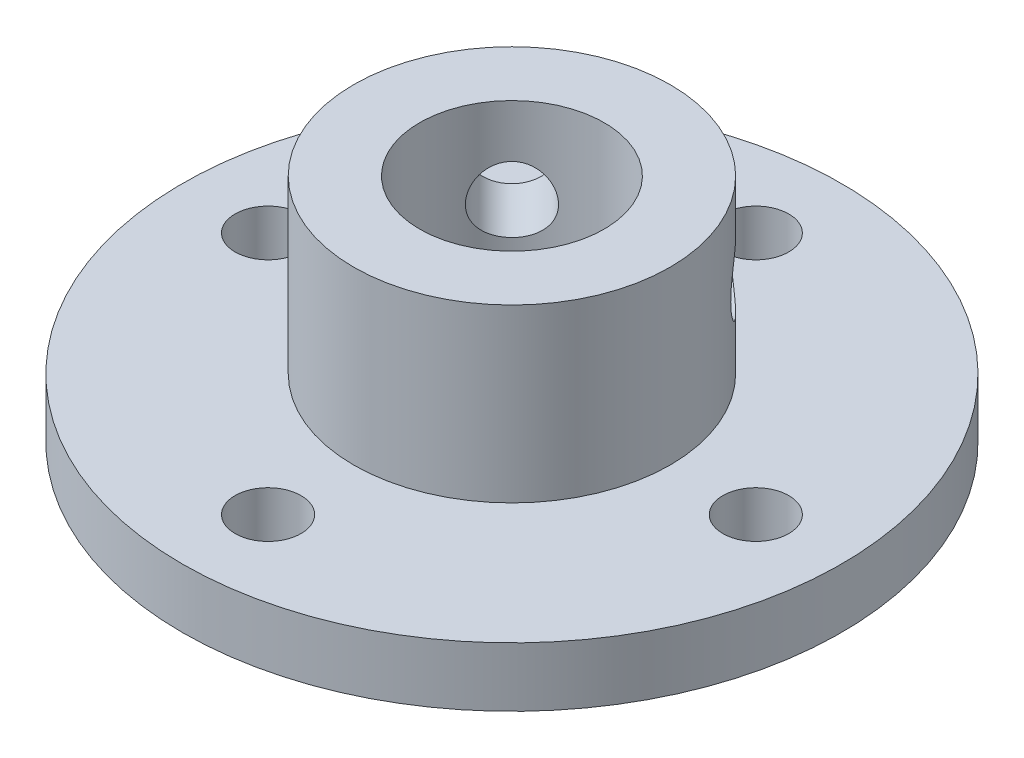
ISO-10303-21;
HEADER;
FILE_DESCRIPTION(('STEP AP214'),'2;1');
FILE_NAME('part.step','',(''),(''),'','','');
FILE_SCHEMA(('AUTOMOTIVE_DESIGN { 1 0 10303 214 1 1 1 1 }'));
ENDSEC;
DATA;
#1=APPLICATION_CONTEXT('core data for automotive mechanical design processes');
#2=APPLICATION_PROTOCOL_DEFINITION('international standard','automotive_design',2000,#1);
#3=PRODUCT_CONTEXT('',#1,'mechanical');
#4=PRODUCT('Part','Part','',(#3));
#5=PRODUCT_RELATED_PRODUCT_CATEGORY('part','',(#4));
#6=PRODUCT_DEFINITION_FORMATION('','',#4);
#7=PRODUCT_DEFINITION_CONTEXT('part definition',#1,'design');
#8=PRODUCT_DEFINITION('design','',#6,#7);
#9=PRODUCT_DEFINITION_SHAPE('','',#8);
#10=(LENGTH_UNIT() NAMED_UNIT(*) SI_UNIT(.MILLI.,.METRE.));
#11=(NAMED_UNIT(*) PLANE_ANGLE_UNIT() SI_UNIT($,.RADIAN.));
#12=(NAMED_UNIT(*) SI_UNIT($,.STERADIAN.) SOLID_ANGLE_UNIT());
#13=UNCERTAINTY_MEASURE_WITH_UNIT(LENGTH_MEASURE(1.E-05),#10,'distance_accuracy_value','');
#14=(GEOMETRIC_REPRESENTATION_CONTEXT(3) GLOBAL_UNCERTAINTY_ASSIGNED_CONTEXT((#13)) GLOBAL_UNIT_ASSIGNED_CONTEXT((#10,
#11,#12)) REPRESENTATION_CONTEXT('',''));
#15=CARTESIAN_POINT('',(0.,0.,0.));
#16=DIRECTION('',(0.,0.,1.));
#17=DIRECTION('',(1.,0.,0.));
#18=AXIS2_PLACEMENT_3D('',#15,#16,#17);
#19=CARTESIAN_POINT('',(0.,4.5,0.));
#20=DIRECTION('',(0.,-1.,0.));
#21=DIRECTION('',(0.,0.,-1.));
#22=AXIS2_PLACEMENT_3D('',#19,#20,#21);
#23=CYLINDRICAL_SURFACE('',#22,25.);
#24=CARTESIAN_POINT('',(0.,4.5,0.));
#25=DIRECTION('',(0.,1.,0.));
#26=DIRECTION('',(0.,0.,1.));
#27=AXIS2_PLACEMENT_3D('',#24,#25,#26);
#28=CIRCLE('',#27,25.);
#29=CARTESIAN_POINT('',(0.,4.5,25.));
#30=VERTEX_POINT('',#29);
#31=EDGE_CURVE('E49',#30,#30,#28,.T.);
#32=ORIENTED_EDGE('',*,*,#31,.F.);
#33=EDGE_LOOP('',(#32));
#34=FACE_BOUND('',#33,.T.);
#35=CARTESIAN_POINT('',(0.,0.,0.));
#36=DIRECTION('',(0.,1.,0.));
#37=DIRECTION('',(0.,0.,1.));
#38=AXIS2_PLACEMENT_3D('',#35,#36,#37);
#39=CIRCLE('',#38,25.);
#40=CARTESIAN_POINT('',(0.,0.,25.));
#41=VERTEX_POINT('',#40);
#42=EDGE_CURVE('E54',#41,#41,#39,.T.);
#43=ORIENTED_EDGE('',*,*,#42,.T.);
#44=EDGE_LOOP('',(#43));
#45=FACE_BOUND('',#44,.T.);
#46=ADVANCED_FACE('F37',(#34,#45),#23,.T.);
#47=CARTESIAN_POINT('',(0.,4.5,0.));
#48=DIRECTION('',(0.,1.,0.));
#49=DIRECTION('',(0.,0.,1.));
#50=AXIS2_PLACEMENT_3D('',#47,#48,#49);
#51=PLANE('',#50);
#52=CARTESIAN_POINT('',(-18.5,4.5,0.));
#53=DIRECTION('',(0.,1.,0.));
#54=DIRECTION('',(0.,0.,1.));
#55=AXIS2_PLACEMENT_3D('',#52,#53,#54);
#56=CIRCLE('',#55,2.5);
#57=CARTESIAN_POINT('',(-18.5,4.5,2.5));
#58=VERTEX_POINT('',#57);
#59=EDGE_CURVE('E95',#58,#58,#56,.T.);
#60=ORIENTED_EDGE('',*,*,#59,.F.);
#61=EDGE_LOOP('',(#60));
#62=FACE_BOUND('',#61,.T.);
#63=CARTESIAN_POINT('',(0.,4.5,-18.5));
#64=DIRECTION('',(0.,1.,0.));
#65=DIRECTION('',(0.,0.,1.));
#66=AXIS2_PLACEMENT_3D('',#63,#64,#65);
#67=CIRCLE('',#66,2.5);
#68=CARTESIAN_POINT('',(0.,4.5,-16.));
#69=VERTEX_POINT('',#68);
#70=EDGE_CURVE('E239',#69,#69,#67,.T.);
#71=ORIENTED_EDGE('',*,*,#70,.F.);
#72=EDGE_LOOP('',(#71));
#73=FACE_BOUND('',#72,.T.);
#74=CARTESIAN_POINT('',(18.5,4.5,0.));
#75=DIRECTION('',(0.,1.,0.));
#76=DIRECTION('',(0.,0.,1.));
#77=AXIS2_PLACEMENT_3D('',#74,#75,#76);
#78=CIRCLE('',#77,2.5);
#79=CARTESIAN_POINT('',(18.5,4.5,2.5));
#80=VERTEX_POINT('',#79);
#81=EDGE_CURVE('E218',#80,#80,#78,.T.);
#82=ORIENTED_EDGE('',*,*,#81,.F.);
#83=EDGE_LOOP('',(#82));
#84=FACE_BOUND('',#83,.T.);
#85=CARTESIAN_POINT('',(0.,4.5,18.5));
#86=DIRECTION('',(0.,1.,0.));
#87=DIRECTION('',(0.,0.,1.));
#88=AXIS2_PLACEMENT_3D('',#85,#86,#87);
#89=CIRCLE('',#88,2.5);
#90=CARTESIAN_POINT('',(0.,4.5,21.));
#91=VERTEX_POINT('',#90);
#92=EDGE_CURVE('E213',#91,#91,#89,.T.);
#93=ORIENTED_EDGE('',*,*,#92,.F.);
#94=EDGE_LOOP('',(#93));
#95=FACE_BOUND('',#94,.T.);
#96=CARTESIAN_POINT('',(0.,4.5,0.));
#97=DIRECTION('',(0.,1.,0.));
#98=DIRECTION('',(0.,0.,1.));
#99=AXIS2_PLACEMENT_3D('',#96,#97,#98);
#100=CIRCLE('',#99,12.);
#101=CARTESIAN_POINT('',(0.,4.5,12.));
#102=VERTEX_POINT('',#101);
#103=EDGE_CURVE('E10',#102,#102,#100,.T.);
#104=ORIENTED_EDGE('',*,*,#103,.F.);
#105=EDGE_LOOP('',(#104));
#106=FACE_BOUND('',#105,.T.);
#107=ORIENTED_EDGE('',*,*,#31,.T.);
#108=EDGE_LOOP('',(#107));
#109=FACE_BOUND('',#108,.T.);
#110=ADVANCED_FACE('F104',(#62,#73,#84,#95,#106,#109),#51,.T.);
#111=CARTESIAN_POINT('',(0.,0.,0.));
#112=DIRECTION('',(0.,1.,0.));
#113=DIRECTION('',(0.,0.,1.));
#114=AXIS2_PLACEMENT_3D('',#111,#112,#113);
#115=PLANE('',#114);
#116=CARTESIAN_POINT('',(-18.5,0.,0.));
#117=DIRECTION('',(0.,1.,0.));
#118=DIRECTION('',(0.,0.,1.));
#119=AXIS2_PLACEMENT_3D('',#116,#117,#118);
#120=CIRCLE('',#119,2.5);
#121=CARTESIAN_POINT('',(-18.5,0.,2.5));
#122=VERTEX_POINT('',#121);
#123=EDGE_CURVE('E226',#122,#122,#120,.F.);
#124=ORIENTED_EDGE('',*,*,#123,.F.);
#125=EDGE_LOOP('',(#124));
#126=FACE_BOUND('',#125,.T.);
#127=CARTESIAN_POINT('',(0.,0.,-18.5));
#128=DIRECTION('',(0.,1.,0.));
#129=DIRECTION('',(0.,0.,1.));
#130=AXIS2_PLACEMENT_3D('',#127,#128,#129);
#131=CIRCLE('',#130,2.5);
#132=CARTESIAN_POINT('',(0.,0.,-16.));
#133=VERTEX_POINT('',#132);
#134=EDGE_CURVE('E241',#133,#133,#131,.F.);
#135=ORIENTED_EDGE('',*,*,#134,.F.);
#136=EDGE_LOOP('',(#135));
#137=FACE_BOUND('',#136,.T.);
#138=CARTESIAN_POINT('',(18.5,0.,0.));
#139=DIRECTION('',(0.,1.,0.));
#140=DIRECTION('',(0.,0.,1.));
#141=AXIS2_PLACEMENT_3D('',#138,#139,#140);
#142=CIRCLE('',#141,2.5);
#143=CARTESIAN_POINT('',(18.5,0.,2.5));
#144=VERTEX_POINT('',#143);
#145=EDGE_CURVE('E215',#144,#144,#142,.F.);
#146=ORIENTED_EDGE('',*,*,#145,.F.);
#147=EDGE_LOOP('',(#146));
#148=FACE_BOUND('',#147,.T.);
#149=CARTESIAN_POINT('',(0.,0.,18.5));
#150=DIRECTION('',(0.,1.,0.));
#151=DIRECTION('',(0.,0.,1.));
#152=AXIS2_PLACEMENT_3D('',#149,#150,#151);
#153=CIRCLE('',#152,2.5);
#154=CARTESIAN_POINT('',(0.,0.,21.));
#155=VERTEX_POINT('',#154);
#156=EDGE_CURVE('E91',#155,#155,#153,.F.);
#157=ORIENTED_EDGE('',*,*,#156,.F.);
#158=EDGE_LOOP('',(#157));
#159=FACE_BOUND('',#158,.T.);
#160=CARTESIAN_POINT('',(0.,0.,0.));
#161=DIRECTION('',(0.,1.,0.));
#162=DIRECTION('',(0.,0.,1.));
#163=AXIS2_PLACEMENT_3D('',#160,#161,#162);
#164=CIRCLE('',#163,7.);
#165=CARTESIAN_POINT('',(0.,0.,7.));
#166=VERTEX_POINT('',#165);
#167=EDGE_CURVE('E225',#166,#166,#164,.F.);
#168=ORIENTED_EDGE('',*,*,#167,.F.);
#169=EDGE_LOOP('',(#168));
#170=FACE_BOUND('',#169,.T.);
#171=ORIENTED_EDGE('',*,*,#42,.F.);
#172=EDGE_LOOP('',(#171));
#173=FACE_BOUND('',#172,.T.);
#174=ADVANCED_FACE('F102',(#126,#137,#148,#159,#170,#173),#115,.F.);
#175=CARTESIAN_POINT('',(0.,17.5,0.));
#176=DIRECTION('',(0.,-1.,0.));
#177=DIRECTION('',(0.,0.,-1.));
#178=AXIS2_PLACEMENT_3D('',#175,#176,#177);
#179=CYLINDRICAL_SURFACE('',#178,12.);
#180=CARTESIAN_POINT('',(-6.53132938338258,11.,-10.0668632893153));
#181=CARTESIAN_POINT('',(-6.53133487932881,11.1387812303038,-10.0668617390174));
#182=CARTESIAN_POINT('',(-6.54128808826859,11.2776239440309,-10.0604236062501));
#183=CARTESIAN_POINT('',(-6.58065201364415,11.551372634634,-10.0347172972168));
#184=CARTESIAN_POINT('',(-6.61007764504304,11.6862755110127,-10.0154392861323));
#185=CARTESIAN_POINT('',(-6.68699421410375,11.9481447456699,-9.96424739820703));
#186=CARTESIAN_POINT('',(-6.73446637944787,12.0751191919836,-9.93234665035149));
#187=CARTESIAN_POINT('',(-6.84542427837764,12.3178489992912,-9.85619977746444));
#188=CARTESIAN_POINT('',(-6.90890936475002,12.43360481346,-9.81195415138288));
#189=CARTESIAN_POINT('',(-7.0503254668031,12.6523907503069,-9.71084697357652));
#190=CARTESIAN_POINT('',(-7.12844328886583,12.7552237872529,-9.65382015873946));
#191=CARTESIAN_POINT('',(-7.29554373030989,12.9435221372962,-9.52816614288542));
#192=CARTESIAN_POINT('',(-7.38452714578847,13.0289861765829,-9.45953809173055));
#193=CARTESIAN_POINT('',(-7.57101959792487,13.1808917761657,-9.3109606347434));
#194=CARTESIAN_POINT('',(-7.66860154983714,13.2471450529265,-9.23090993918123));
#195=CARTESIAN_POINT('',(-7.86808311057415,13.3575321057196,-9.06147726894635));
#196=CARTESIAN_POINT('',(-7.96998227934527,13.4016681303071,-8.97209624396046));
#197=CARTESIAN_POINT('',(-8.17315453406269,13.4659515222349,-8.78738398279199));
#198=CARTESIAN_POINT('',(-8.27441582283363,13.4864320343903,-8.69215578756287));
#199=CARTESIAN_POINT('',(-8.47454647077655,13.503863391514,-8.49715083281107));
#200=CARTESIAN_POINT('',(-8.57341607812188,13.5008166883862,-8.39737454834779));
#201=CARTESIAN_POINT('',(-8.76440918400657,13.4715307980865,-8.19780003379184));
#202=CARTESIAN_POINT('',(-8.85661329365778,13.4456505620838,-8.09802594628021));
#203=CARTESIAN_POINT('',(-9.03365817615235,13.3720027493374,-7.90004227271771));
#204=CARTESIAN_POINT('',(-9.11849863695346,13.3242342455938,-7.80183275311085));
#205=CARTESIAN_POINT('',(-9.27959942289516,13.207839895749,-7.60952632758728));
#206=CARTESIAN_POINT('',(-9.35579795336431,13.1390754115807,-7.51546166387251));
#207=CARTESIAN_POINT('',(-9.49766943210913,12.9827439943192,-7.33535540302338));
#208=CARTESIAN_POINT('',(-9.56334107000406,12.8951747235877,-7.24931480527615));
#209=CARTESIAN_POINT('',(-9.68440890089991,12.7017567502179,-7.08679782514177));
#210=CARTESIAN_POINT('',(-9.73958745763629,12.5955938800361,-7.01053291264737));
#211=CARTESIAN_POINT('',(-9.83747417500681,12.3690359020104,-6.8725019804371));
#212=CARTESIAN_POINT('',(-9.88018205786135,12.2486404772255,-6.81073628369186));
#213=CARTESIAN_POINT('',(-9.95279969408107,11.9965754903424,-6.70417529407958));
#214=CARTESIAN_POINT('',(-9.98267743292409,11.8648786986131,-6.65942248428481));
#215=CARTESIAN_POINT('',(-10.0291950638491,11.5942167612612,-6.5891608066585));
#216=CARTESIAN_POINT('',(-10.045836842316,11.4552526543838,-6.56364919660398));
#217=CARTESIAN_POINT('',(-10.0655469024328,11.1767605873622,-6.5333826752007));
#218=CARTESIAN_POINT('',(-10.0688610790404,11.0372908309259,-6.52825176094147));
#219=CARTESIAN_POINT('',(-10.0625628885079,10.7593483769197,-6.53795538212273));
#220=CARTESIAN_POINT('',(-10.0529513211238,10.6208756181953,-6.55278868231526));
#221=CARTESIAN_POINT('',(-10.0210620998798,10.3503589678838,-6.60144962996093));
#222=CARTESIAN_POINT('',(-9.99891913741021,10.2182626656423,-6.63507524448911));
#223=CARTESIAN_POINT('',(-9.94226286706435,9.96255202111679,-6.71967148787454));
#224=CARTESIAN_POINT('',(-9.90774846723438,9.8389384286992,-6.7706436477888));
#225=CARTESIAN_POINT('',(-9.82608452648079,9.60178711756754,-6.88863290121946));
#226=CARTESIAN_POINT('',(-9.77876408176181,9.48841559106766,-6.9558656061476));
#227=CARTESIAN_POINT('',(-9.67218737321747,9.27671350168988,-7.10331244588088));
#228=CARTESIAN_POINT('',(-9.61292977103728,9.17838462752154,-7.18352803608604));
#229=CARTESIAN_POINT('',(-9.48208937094306,8.99787457380567,-7.35539374066881));
#230=CARTESIAN_POINT('',(-9.41031656300606,8.91599180994723,-7.44721303725591));
#231=CARTESIAN_POINT('',(-9.25626420801318,8.77282249582404,-7.63783791812182));
#232=CARTESIAN_POINT('',(-9.17398512541447,8.7115350355251,-7.73664319348117));
#233=CARTESIAN_POINT('',(-9.00105015238936,8.6117226413653,-7.93715958350876));
#234=CARTESIAN_POINT('',(-8.91044819533833,8.57306166891132,-8.03884939535759));
#235=CARTESIAN_POINT('',(-8.72259915858252,8.51917119198381,-8.24229433045305));
#236=CARTESIAN_POINT('',(-8.62535295257144,8.50393861293454,-8.34404944337634));
#237=CARTESIAN_POINT('',(-8.4287845848372,8.49746475590296,-8.54252509628538));
#238=CARTESIAN_POINT('',(-8.32953622009757,8.5057762000105,-8.63930440530465));
#239=CARTESIAN_POINT('',(-8.13018065096845,8.5451612773059,-8.82716978169079));
#240=CARTESIAN_POINT('',(-8.03007345934174,8.57623457281369,-8.9182559334959));
#241=CARTESIAN_POINT('',(-7.83244169429246,8.66005558929697,-9.09231354771901));
#242=CARTESIAN_POINT('',(-7.73491094921994,8.71274532770566,-9.1753059887069));
#243=CARTESIAN_POINT('',(-7.54535174631895,8.83824479546456,-9.33181620692281));
#244=CARTESIAN_POINT('',(-7.45332376843078,8.91105627668834,-9.40533315836195));
#245=CARTESIAN_POINT('',(-7.27637718014573,9.07621933598451,-9.54290988105682));
#246=CARTESIAN_POINT('',(-7.19160995858152,9.1688885761055,-9.60678304511539));
#247=CARTESIAN_POINT('',(-7.03412166099969,9.37048900200207,-9.72269081992513));
#248=CARTESIAN_POINT('',(-6.96140346202397,9.47942405992639,-9.77472260431951));
#249=CARTESIAN_POINT('',(-6.83011042491676,9.71201820484104,-9.86692055624919));
#250=CARTESIAN_POINT('',(-6.77171385203743,9.83583682282062,-9.90693843404642));
#251=CARTESIAN_POINT('',(-6.67277452593493,10.0936503120621,-9.97384958355321));
#252=CARTESIAN_POINT('',(-6.63221604602192,10.2276360968785,-10.0007544184556));
#253=CARTESIAN_POINT('',(-6.57831974833162,10.4682125631532,-10.0362572871906));
#254=CARTESIAN_POINT('',(-6.56074481156641,10.5734590731905,-10.047727323569));
#255=CARTESIAN_POINT('',(-6.53724774254483,10.7857915610376,-10.0630307692356));
#256=CARTESIAN_POINT('',(-6.53132514116846,10.8928774646188,-10.0668644859601));
#257=CARTESIAN_POINT('',(-6.53132938338258,11.,-10.0668632893153));
#258=B_SPLINE_CURVE_WITH_KNOTS('',3,(#180,#181,#182,#183,#184,#185,#186,#187,#188,#189,#190,
#191,#192,#193,#194,#195,#196,#197,#198,#199,#200,#201,#202,#203,#204,#205,#206,#207,#208,#209,
#210,#211,#212,#213,#214,#215,#216,#217,#218,#219,#220,#221,#222,#223,#224,#225,#226,#227,#228,
#229,#230,#231,#232,#233,#234,#235,#236,#237,#238,#239,#240,#241,#242,#243,#244,#245,#246,#247,
#248,#249,#250,#251,#252,#253,#254,#255,#256,#257),.UNSPECIFIED.,.T.,.F.,(4,2,2,2,2,2,2,2,2,2,2,
2,2,2,2,2,2,2,2,2,2,2,2,2,2,2,2,2,2,2,2,2,2,2,2,2,2,2,4),(0.,0.415951308142539,
0.832221584834942,1.24806002960546,1.66388166963158,2.0854266693577,2.50700257327748,
2.93258052533688,3.35811520213866,3.77758097718529,4.19700303792678,4.60994682832923,
5.02290810911741,5.43865743955899,5.8544584820852,6.27811724489827,6.70178544383256,
7.12650474664976,7.55116350775194,7.96795032019585,8.38471134593049,8.79707572463846,
9.20947650928062,9.62767835869302,10.0459271216437,10.4711891750669,10.8964324351808,
11.3190919929707,11.7416960791916,12.1563258784529,12.5709495266596,12.984468211702,
13.3980229105635,13.8187663795715,14.2396101685507,14.6654530271772,15.0909196914727,
15.4119973517483,15.7330620852562),.UNSPECIFIED.);
#259=CARTESIAN_POINT('',(-6.53132938338258,11.,-10.0668632893153));
#260=VERTEX_POINT('',#259);
#261=EDGE_CURVE('E68',#260,#260,#258,.T.);
#262=ORIENTED_EDGE('',*,*,#261,.T.);
#263=EDGE_LOOP('',(#262));
#264=FACE_BOUND('',#263,.T.);
#265=CARTESIAN_POINT('',(10.0668632893153,11.,-6.53132938338254));
#266=CARTESIAN_POINT('',(10.0668617390174,11.1387812303038,-6.53133487932878));
#267=CARTESIAN_POINT('',(10.0604236062502,11.2776239440309,-6.54128808826856));
#268=CARTESIAN_POINT('',(10.0347172972168,11.551372634634,-6.58065201364412));
#269=CARTESIAN_POINT('',(10.0154392861323,11.6862755110127,-6.61007764504301));
#270=CARTESIAN_POINT('',(9.96424739820706,11.9481447456699,-6.68699421410371));
#271=CARTESIAN_POINT('',(9.93234665035152,12.0751191919836,-6.73446637944784));
#272=CARTESIAN_POINT('',(9.85619977746447,12.3178489992912,-6.84542427837761));
#273=CARTESIAN_POINT('',(9.81195415138291,12.43360481346,-6.90890936474999));
#274=CARTESIAN_POINT('',(9.71084697357654,12.6523907503069,-7.05032546680307));
#275=CARTESIAN_POINT('',(9.65382015873948,12.7552237872529,-7.1284432888658));
#276=CARTESIAN_POINT('',(9.52816614288545,12.9435221372962,-7.29554373030985));
#277=CARTESIAN_POINT('',(9.45953809173058,13.0289861765829,-7.38452714578843));
#278=CARTESIAN_POINT('',(9.31096063474343,13.1808917761657,-7.57101959792484));
#279=CARTESIAN_POINT('',(9.23090993918126,13.2471450529265,-7.66860154983711));
#280=CARTESIAN_POINT('',(9.06147726894638,13.3575321057196,-7.86808311057412));
#281=CARTESIAN_POINT('',(8.97209624396049,13.4016681303071,-7.96998227934524));
#282=CARTESIAN_POINT('',(8.78738398279202,13.4659515222349,-8.17315453406267));
#283=CARTESIAN_POINT('',(8.6921557875629,13.4864320343903,-8.2744158228336));
#284=CARTESIAN_POINT('',(8.4971508328111,13.503863391514,-8.47454647077652));
#285=CARTESIAN_POINT('',(8.39737454834781,13.5008166883862,-8.57341607812186));
#286=CARTESIAN_POINT('',(8.19780003379187,13.4715307980865,-8.76440918400655));
#287=CARTESIAN_POINT('',(8.09802594628024,13.4456505620838,-8.85661329365775));
#288=CARTESIAN_POINT('',(7.90004227271774,13.3720027493374,-9.03365817615232));
#289=CARTESIAN_POINT('',(7.80183275311088,13.3242342455938,-9.11849863695343));
#290=CARTESIAN_POINT('',(7.60952632758731,13.207839895749,-9.27959942289513));
#291=CARTESIAN_POINT('',(7.51546166387254,13.1390754115807,-9.35579795336429));
#292=CARTESIAN_POINT('',(7.33535540302342,12.9827439943192,-9.49766943210911));
#293=CARTESIAN_POINT('',(7.24931480527619,12.8951747235877,-9.56334107000404));
#294=CARTESIAN_POINT('',(7.0867978251418,12.7017567502179,-9.68440890089989));
#295=CARTESIAN_POINT('',(7.01053291264741,12.5955938800361,-9.73958745763627));
#296=CARTESIAN_POINT('',(6.87250198043714,12.3690359020104,-9.83747417500679));
#297=CARTESIAN_POINT('',(6.81073628369189,12.2486404772255,-9.88018205786132));
#298=CARTESIAN_POINT('',(6.70417529407962,11.9965754903424,-9.95279969408104));
#299=CARTESIAN_POINT('',(6.65942248428484,11.8648786986131,-9.98267743292407));
#300=CARTESIAN_POINT('',(6.58916080665854,11.5942167612612,-10.0291950638491));
#301=CARTESIAN_POINT('',(6.56364919660402,11.4552526543838,-10.045836842316));
#302=CARTESIAN_POINT('',(6.53338267520073,11.1767605873622,-10.0655469024328));
#303=CARTESIAN_POINT('',(6.5282517609415,11.0372908309259,-10.0688610790403));
#304=CARTESIAN_POINT('',(6.53795538212276,10.7593483769197,-10.0625628885078));
#305=CARTESIAN_POINT('',(6.55278868231529,10.6208756181953,-10.0529513211237));
#306=CARTESIAN_POINT('',(6.60144962996097,10.3503589678837,-10.0210620998798));
#307=CARTESIAN_POINT('',(6.63507524448914,10.2182626656423,-9.99891913741019));
#308=CARTESIAN_POINT('',(6.71967148787457,9.96255202111679,-9.94226286706433));
#309=CARTESIAN_POINT('',(6.77064364778884,9.8389384286992,-9.90774846723436));
#310=CARTESIAN_POINT('',(6.8886329012195,9.60178711756754,-9.82608452648077));
#311=CARTESIAN_POINT('',(6.95586560614764,9.48841559106766,-9.77876408176178));
#312=CARTESIAN_POINT('',(7.10331244588091,9.27671350168987,-9.67218737321745));
#313=CARTESIAN_POINT('',(7.18352803608607,9.17838462752154,-9.61292977103726));
#314=CARTESIAN_POINT('',(7.35539374066884,8.99787457380567,-9.48208937094304));
#315=CARTESIAN_POINT('',(7.44721303725595,8.91599180994723,-9.41031656300603));
#316=CARTESIAN_POINT('',(7.63783791812186,8.77282249582404,-9.25626420801315));
#317=CARTESIAN_POINT('',(7.73664319348121,8.7115350355251,-9.17398512541444));
#318=CARTESIAN_POINT('',(7.93715958350879,8.6117226413653,-9.00105015238933));
#319=CARTESIAN_POINT('',(8.03884939535762,8.57306166891131,-8.9104481953383));
#320=CARTESIAN_POINT('',(8.24229433045308,8.51917119198381,-8.72259915858249));
#321=CARTESIAN_POINT('',(8.34404944337637,8.50393861293454,-8.62535295257141));
#322=CARTESIAN_POINT('',(8.5425250962854,8.49746475590296,-8.42878458483717));
#323=CARTESIAN_POINT('',(8.63930440530468,8.5057762000105,-8.32953622009754));
#324=CARTESIAN_POINT('',(8.82716978169082,8.5451612773059,-8.13018065096842));
#325=CARTESIAN_POINT('',(8.91825593349593,8.57623457281369,-8.03007345934172));
#326=CARTESIAN_POINT('',(9.09231354771904,8.66005558929697,-7.83244169429243));
#327=CARTESIAN_POINT('',(9.17530598870693,8.71274532770565,-7.73491094921991));
#328=CARTESIAN_POINT('',(9.33181620692283,8.83824479546456,-7.54535174631892));
#329=CARTESIAN_POINT('',(9.40533315836197,8.91105627668834,-7.45332376843074));
#330=CARTESIAN_POINT('',(9.54290988105685,9.07621933598451,-7.2763771801457));
#331=CARTESIAN_POINT('',(9.60678304511542,9.1688885761055,-7.19160995858148));
#332=CARTESIAN_POINT('',(9.72269081992516,9.37048900200207,-7.03412166099965));
#333=CARTESIAN_POINT('',(9.77472260431954,9.47942405992639,-6.96140346202394));
#334=CARTESIAN_POINT('',(9.86692055624921,9.71201820484104,-6.83011042491672));
#335=CARTESIAN_POINT('',(9.90693843404644,9.83583682282062,-6.77171385203739));
#336=CARTESIAN_POINT('',(9.97384958355323,10.0936503120621,-6.6727745259349));
#337=CARTESIAN_POINT('',(10.0007544184556,10.2276360968785,-6.63221604602189));
#338=CARTESIAN_POINT('',(10.0362572871907,10.4682125631532,-6.57831974833158));
#339=CARTESIAN_POINT('',(10.047727323569,10.5734590731905,-6.56074481156638));
#340=CARTESIAN_POINT('',(10.0630307692356,10.7857915610376,-6.5372477425448));
#341=CARTESIAN_POINT('',(10.0668644859601,10.8928774646188,-6.53132514116842));
#342=CARTESIAN_POINT('',(10.0668632893153,11.,-6.53132938338254));
#343=B_SPLINE_CURVE_WITH_KNOTS('',3,(#265,#266,#267,#268,#269,#270,#271,#272,#273,#274,#275,
#276,#277,#278,#279,#280,#281,#282,#283,#284,#285,#286,#287,#288,#289,#290,#291,#292,#293,#294,
#295,#296,#297,#298,#299,#300,#301,#302,#303,#304,#305,#306,#307,#308,#309,#310,#311,#312,#313,
#314,#315,#316,#317,#318,#319,#320,#321,#322,#323,#324,#325,#326,#327,#328,#329,#330,#331,#332,
#333,#334,#335,#336,#337,#338,#339,#340,#341,#342),.UNSPECIFIED.,.T.,.F.,(4,2,2,2,2,2,2,2,2,2,2,
2,2,2,2,2,2,2,2,2,2,2,2,2,2,2,2,2,2,2,2,2,2,2,2,2,2,2,4),(0.,0.415951308142539,
0.832221584834941,1.24806002960546,1.66388166963158,2.0854266693577,2.50700257327748,
2.93258052533688,3.35811520213866,3.77758097718529,4.19700303792678,4.60994682832922,
5.02290810911741,5.43865743955899,5.8544584820852,6.27811724489827,6.70178544383256,
7.12650474664976,7.55116350775194,7.96795032019585,8.38471134593049,8.79707572463846,
9.20947650928062,9.62767835869302,10.0459271216437,10.4711891750669,10.8964324351808,
11.3190919929707,11.7416960791916,12.1563258784529,12.5709495266596,12.984468211702,
13.3980229105635,13.8187663795715,14.2396101685507,14.6654530271772,15.0909196914727,
15.4119973517483,15.7330620852562),.UNSPECIFIED.);
#344=CARTESIAN_POINT('',(10.0668632893153,11.,-6.53132938338254));
#345=VERTEX_POINT('',#344);
#346=EDGE_CURVE('E67',#345,#345,#343,.T.);
#347=ORIENTED_EDGE('',*,*,#346,.T.);
#348=EDGE_LOOP('',(#347));
#349=FACE_BOUND('',#348,.T.);
#350=CARTESIAN_POINT('',(0.,17.5,0.));
#351=DIRECTION('',(0.,1.,0.));
#352=DIRECTION('',(0.,0.,1.));
#353=AXIS2_PLACEMENT_3D('',#350,#351,#352);
#354=CIRCLE('',#353,12.);
#355=CARTESIAN_POINT('',(0.,17.5,12.));
#356=VERTEX_POINT('',#355);
#357=EDGE_CURVE('E57',#356,#356,#354,.T.);
#358=ORIENTED_EDGE('',*,*,#357,.F.);
#359=EDGE_LOOP('',(#358));
#360=FACE_BOUND('',#359,.T.);
#361=ORIENTED_EDGE('',*,*,#103,.T.);
#362=EDGE_LOOP('',(#361));
#363=FACE_BOUND('',#362,.T.);
#364=ADVANCED_FACE('F97',(#264,#349,#360,#363),#179,.T.);
#365=CARTESIAN_POINT('',(0.,17.5,0.));
#366=DIRECTION('',(0.,1.,0.));
#367=DIRECTION('',(0.,0.,1.));
#368=AXIS2_PLACEMENT_3D('',#365,#366,#367);
#369=PLANE('',#368);
#370=CARTESIAN_POINT('',(0.,17.5,0.));
#371=DIRECTION('',(0.,1.,0.));
#372=DIRECTION('',(0.,0.,1.));
#373=AXIS2_PLACEMENT_3D('',#370,#371,#372);
#374=CIRCLE('',#373,7.);
#375=CARTESIAN_POINT('',(0.,17.5,7.));
#376=VERTEX_POINT('',#375);
#377=EDGE_CURVE('E223',#376,#376,#374,.T.);
#378=ORIENTED_EDGE('',*,*,#377,.F.);
#379=EDGE_LOOP('',(#378));
#380=FACE_BOUND('',#379,.T.);
#381=ORIENTED_EDGE('',*,*,#357,.T.);
#382=EDGE_LOOP('',(#381));
#383=FACE_BOUND('',#382,.T.);
#384=ADVANCED_FACE('F101',(#380,#383),#369,.T.);
#385=CARTESIAN_POINT('',(0.,-19.7989898732233,0.));
#386=DIRECTION('',(0.,1.,0.));
#387=DIRECTION('',(0.,0.,1.));
#388=AXIS2_PLACEMENT_3D('',#385,#386,#387);
#389=CYLINDRICAL_SURFACE('',#388,7.);
#390=CARTESIAN_POINT('',(-2.85554354926038,11.,-6.39107745519309));
#391=CARTESIAN_POINT('',(-2.85553966124099,10.8644729375943,-6.39107771283521));
#392=CARTESIAN_POINT('',(-2.8663744660416,10.7289661363285,-6.38627069762982));
#393=CARTESIAN_POINT('',(-2.90898085951804,10.4620070809665,-6.36697480548154));
#394=CARTESIAN_POINT('',(-2.94075348226984,10.3305550274615,-6.3524854503472));
#395=CARTESIAN_POINT('',(-3.02319541023643,10.0756252409608,-6.31366288739276));
#396=CARTESIAN_POINT('',(-3.07382314973596,9.95213066315779,-6.28935132250584));
#397=CARTESIAN_POINT('',(-3.19130340130277,9.71573913120065,-6.23056039028846));
#398=CARTESIAN_POINT('',(-3.25816026187169,9.60284502864644,-6.19607829728877));
#399=CARTESIAN_POINT('',(-3.40809547786256,9.38577880109018,-6.11493485038334));
#400=CARTESIAN_POINT('',(-3.49172538328329,9.28215213793684,-6.06783310789548));
#401=CARTESIAN_POINT('',(-3.6697719705033,9.09149315131818,-5.9618366983527));
#402=CARTESIAN_POINT('',(-3.76419068335222,9.00446396067198,-5.9029398092236));
#403=CARTESIAN_POINT('',(-3.96317094495432,8.84691091314746,-5.77130079412989));
#404=CARTESIAN_POINT('',(-4.06795383207531,8.77697050756981,-5.69819160997948));
#405=CARTESIAN_POINT('',(-4.28094325022805,8.65946494454605,-5.539954034882));
#406=CARTESIAN_POINT('',(-4.38914870080513,8.61189279953219,-5.45482940822892));
#407=CARTESIAN_POINT('',(-4.60049462290534,8.54235905119993,-5.27766070218659));
#408=CARTESIAN_POINT('',(-4.70366639469511,8.51946043976448,-5.18602251724982));
#409=CARTESIAN_POINT('',(-4.90564257222852,8.4969316101723,-4.99539099910902));
#410=CARTESIAN_POINT('',(-5.00444825838244,8.49729452434681,-4.89639984539627));
#411=CARTESIAN_POINT('',(-5.19031578854741,8.5207111975646,-4.69874593977394));
#412=CARTESIAN_POINT('',(-5.27770585133489,8.54274450638211,-4.60026834887626));
#413=CARTESIAN_POINT('',(-5.4436987845755,8.6071728511432,-4.4025913432544));
#414=CARTESIAN_POINT('',(-5.52230104098802,8.64956930884994,-4.30339187860507));
#415=CARTESIAN_POINT('',(-5.67051982673101,8.75404691582561,-4.10617198530113));
#416=CARTESIAN_POINT('',(-5.73999489220346,8.81639576699443,-4.0081875974077));
#417=CARTESIAN_POINT('',(-5.86811567623864,8.9587791400987,-3.81816334310192));
#418=CARTESIAN_POINT('',(-5.92675808481177,9.03881905129852,-3.72612529920165));
#419=CARTESIAN_POINT('',(-6.03603037323138,9.21933077593155,-3.54654430527839));
#420=CARTESIAN_POINT('',(-6.08606337225113,9.32066690193269,-3.45950564140968));
#421=CARTESIAN_POINT('',(-6.17439329184738,9.53834348743058,-3.29928140929482));
#422=CARTESIAN_POINT('',(-6.21268780371928,9.65468701945542,-3.22609868542496));
#423=CARTESIAN_POINT('',(-6.27857806699554,9.90187765191961,-3.09594841155387));
#424=CARTESIAN_POINT('',(-6.30596300283136,10.0329530664133,-3.03930554889315));
#425=CARTESIAN_POINT('',(-6.3494006133781,10.304179451939,-2.94749423978835));
#426=CARTESIAN_POINT('',(-6.36545889501719,10.4443258950592,-2.91231516948889));
#427=CARTESIAN_POINT('',(-6.38598543862272,10.7220838857687,-2.86701598892652));
#428=CARTESIAN_POINT('',(-6.3910016500296,10.859461812678,-2.85571233669384));
#429=CARTESIAN_POINT('',(-6.39115152441262,11.1342333752167,-2.85537864690288));
#430=CARTESIAN_POINT('',(-6.3862873414224,11.2716270008938,-2.86634375451221));
#431=CARTESIAN_POINT('',(-6.36701929899289,11.5365737747273,-2.90887682247523));
#432=CARTESIAN_POINT('',(-6.35301928536579,11.6642987435769,-2.93957180599349));
#433=CARTESIAN_POINT('',(-6.31569068945927,11.9125899149936,-3.01893367690651));
#434=CARTESIAN_POINT('',(-6.29236030578469,12.0331547299992,-3.06760403463057));
#435=CARTESIAN_POINT('',(-6.23508587967829,12.2684001774881,-3.18244363064597));
#436=CARTESIAN_POINT('',(-6.200798158515,12.3827259257826,-3.24916693304801));
#437=CARTESIAN_POINT('',(-6.12151782935123,12.598207720803,-3.39617193627439));
#438=CARTESIAN_POINT('',(-6.07652162804123,12.6993593291826,-3.47645818561603));
#439=CARTESIAN_POINT('',(-5.97262416662697,12.8915426899962,-3.65222436470339));
#440=CARTESIAN_POINT('',(-5.9130807527264,12.9816793854627,-3.74830655262146));
#441=CARTESIAN_POINT('',(-5.78156981015857,13.1422926850507,-3.94813081886599));
#442=CARTESIAN_POINT('',(-5.70960248918934,13.2127696177849,-4.05187276912294));
#443=CARTESIAN_POINT('',(-5.55415428370194,13.3315002234082,-4.26243922986838));
#444=CARTESIAN_POINT('',(-5.47073434095375,13.3798660174607,-4.36924520233167));
#445=CARTESIAN_POINT('',(-5.29353589721683,13.4530468590572,-4.58231814015067));
#446=CARTESIAN_POINT('',(-5.19976177693276,13.4778718240885,-4.68858531371181));
#447=CARTESIAN_POINT('',(-5.00954135684015,13.5022729666443,-4.89109035125707));
#448=CARTESIAN_POINT('',(-4.91350485470449,13.5031261064489,-4.98756078423182));
#449=CARTESIAN_POINT('',(-4.71720610289481,13.4827846230133,-5.17361072561657));
#450=CARTESIAN_POINT('',(-4.6169442865863,13.4615922555955,-5.26319093806618));
#451=CARTESIAN_POINT('',(-4.41758016938122,13.3986398707044,-5.43154487938931));
#452=CARTESIAN_POINT('',(-4.31849607958581,13.3573092766315,-5.51050212227274));
#453=CARTESIAN_POINT('',(-4.12269235555989,13.2556669092691,-5.65848788624247));
#454=CARTESIAN_POINT('',(-4.02597316804375,13.1953515792864,-5.72751454335074));
#455=CARTESIAN_POINT('',(-3.83433783344673,13.0546886476762,-5.8576281993987));
#456=CARTESIAN_POINT('',(-3.73964902000121,12.9736355249015,-5.91828651859633));
#457=CARTESIAN_POINT('',(-3.5597466476415,12.7949475408083,-6.02821183452401));
#458=CARTESIAN_POINT('',(-3.47453634357149,12.6973070124168,-6.07747492445378));
#459=CARTESIAN_POINT('',(-3.31329493256607,12.4827811728258,-6.16692646648997));
#460=CARTESIAN_POINT('',(-3.23787824540467,12.3652101225806,-6.20658376188909));
#461=CARTESIAN_POINT('',(-3.10490271394881,12.1172615856897,-6.27416660412272));
#462=CARTESIAN_POINT('',(-3.04734266495795,11.9868849637522,-6.30209294243014));
#463=CARTESIAN_POINT('',(-2.953273049658,11.7162590761611,-6.34672563124235));
#464=CARTESIAN_POINT('',(-2.91685156686772,11.5759711936215,-6.3633850800315));
#465=CARTESIAN_POINT('',(-2.86799491878587,11.2904461064685,-6.3855580569585));
#466=CARTESIAN_POINT('',(-2.85554771510607,11.1452114231358,-6.39107717914063));
#467=CARTESIAN_POINT('',(-2.85554354926038,11.,-6.39107745519309));
#468=B_SPLINE_CURVE_WITH_KNOTS('',3,(#390,#391,#392,#393,#394,#395,#396,#397,#398,#399,#400,
#401,#402,#403,#404,#405,#406,#407,#408,#409,#410,#411,#412,#413,#414,#415,#416,#417,#418,#419,
#420,#421,#422,#423,#424,#425,#426,#427,#428,#429,#430,#431,#432,#433,#434,#435,#436,#437,#438,
#439,#440,#441,#442,#443,#444,#445,#446,#447,#448,#449,#450,#451,#452,#453,#454,#455,#456,#457,
#458,#459,#460,#461,#462,#463,#464,#465,#466,#467),.UNSPECIFIED.,.T.,.F.,(4,2,2,2,2,2,2,2,2,2,2,
2,2,2,2,2,2,2,2,2,2,2,2,2,2,2,2,2,2,2,2,2,2,2,2,2,2,2,4),(0.,0.406041766331002,
0.812103587736961,1.21727550243125,1.62255610072681,2.04441002530116,2.46634349733964,
2.90112813694272,3.33577686482073,3.75326460234542,4.17062908250815,4.56923737347846,
4.96787349948484,5.37209971069683,5.77644923231492,6.20244167773848,6.62852147719004,
7.06247609308417,7.4962157414176,7.90789453596191,8.31948358967585,8.71400941843617,
9.10861145427952,9.5170588594572,9.92564351590594,10.3573204832378,10.7889902346611,
11.2184461110406,11.6477209819893,12.0540827015585,12.4604028439597,12.8584146445103,
13.2565010549614,13.67053016118,14.0847010056159,14.5182116217954,14.9516929848591,
15.386967912939,15.8220242160484),.UNSPECIFIED.);
#469=CARTESIAN_POINT('',(-2.85554354926038,11.,-6.39107745519309));
#470=VERTEX_POINT('',#469);
#471=EDGE_CURVE('E40',#470,#470,#468,.T.);
#472=ORIENTED_EDGE('',*,*,#471,.T.);
#473=EDGE_LOOP('',(#472));
#474=FACE_BOUND('',#473,.T.);
#475=CARTESIAN_POINT('',(6.3910774551931,11.,-2.85554354926036));
#476=CARTESIAN_POINT('',(6.39107771283522,10.8644729375943,-2.85553966124097));
#477=CARTESIAN_POINT('',(6.38627069762983,10.7289661363285,-2.86637446604158));
#478=CARTESIAN_POINT('',(6.36697480548155,10.4620070809665,-2.90898085951802));
#479=CARTESIAN_POINT('',(6.35248545034721,10.3305550274615,-2.94075348226982));
#480=CARTESIAN_POINT('',(6.31366288739278,10.0756252409608,-3.0231954102364));
#481=CARTESIAN_POINT('',(6.28935132250585,9.95213066315779,-3.07382314973594));
#482=CARTESIAN_POINT('',(6.23056039028847,9.71573913120065,-3.19130340130275));
#483=CARTESIAN_POINT('',(6.19607829728879,9.60284502864644,-3.25816026187167));
#484=CARTESIAN_POINT('',(6.11493485038335,9.38577880109018,-3.40809547786253));
#485=CARTESIAN_POINT('',(6.06783310789549,9.28215213793684,-3.49172538328327));
#486=CARTESIAN_POINT('',(5.96183669835272,9.09149315131818,-3.66977197050328));
#487=CARTESIAN_POINT('',(5.90293980922361,9.00446396067198,-3.7641906833522));
#488=CARTESIAN_POINT('',(5.7713007941299,8.84691091314746,-3.9631709449543));
#489=CARTESIAN_POINT('',(5.69819160997949,8.77697050756981,-4.06795383207529));
#490=CARTESIAN_POINT('',(5.53995403488202,8.65946494454605,-4.28094325022803));
#491=CARTESIAN_POINT('',(5.45482940822893,8.61189279953219,-4.38914870080511));
#492=CARTESIAN_POINT('',(5.2776607021866,8.54235905119993,-4.60049462290533));
#493=CARTESIAN_POINT('',(5.18602251724984,8.51946043976448,-4.7036663946951));
#494=CARTESIAN_POINT('',(4.99539099910903,8.4969316101723,-4.9056425722285));
#495=CARTESIAN_POINT('',(4.89639984539628,8.49729452434681,-5.00444825838243));
#496=CARTESIAN_POINT('',(4.69874593977395,8.5207111975646,-5.19031578854739));
#497=CARTESIAN_POINT('',(4.60026834887628,8.54274450638211,-5.27770585133488));
#498=CARTESIAN_POINT('',(4.40259134325442,8.6071728511432,-5.44369878457549));
#499=CARTESIAN_POINT('',(4.30339187860509,8.64956930884994,-5.522301040988));
#500=CARTESIAN_POINT('',(4.10617198530115,8.75404691582561,-5.67051982673099));
#501=CARTESIAN_POINT('',(4.00818759740772,8.81639576699443,-5.73999489220344));
#502=CARTESIAN_POINT('',(3.81816334310193,8.9587791400987,-5.86811567623862));
#503=CARTESIAN_POINT('',(3.72612529920167,9.03881905129852,-5.92675808481175));
#504=CARTESIAN_POINT('',(3.54654430527841,9.21933077593156,-6.03603037323136));
#505=CARTESIAN_POINT('',(3.4595056414097,9.32066690193269,-6.08606337225112));
#506=CARTESIAN_POINT('',(3.29928140929484,9.53834348743058,-6.17439329184737));
#507=CARTESIAN_POINT('',(3.22609868542498,9.65468701945543,-6.21268780371927));
#508=CARTESIAN_POINT('',(3.09594841155389,9.90187765191962,-6.27857806699553));
#509=CARTESIAN_POINT('',(3.03930554889318,10.0329530664133,-6.30596300283135));
#510=CARTESIAN_POINT('',(2.94749423978837,10.304179451939,-6.34940061337809));
#511=CARTESIAN_POINT('',(2.91231516948891,10.4443258950592,-6.36545889501718));
#512=CARTESIAN_POINT('',(2.86701598892654,10.7220838857687,-6.38598543862271));
#513=CARTESIAN_POINT('',(2.85571233669386,10.859461812678,-6.39100165002959));
#514=CARTESIAN_POINT('',(2.85537864690291,11.1342333752167,-6.39115152441261));
#515=CARTESIAN_POINT('',(2.86634375451223,11.2716270008938,-6.38628734142239));
#516=CARTESIAN_POINT('',(2.90887682247525,11.5365737747273,-6.36701929899288));
#517=CARTESIAN_POINT('',(2.93957180599351,11.6642987435769,-6.35301928536578));
#518=CARTESIAN_POINT('',(3.01893367690654,11.9125899149936,-6.31569068945926));
#519=CARTESIAN_POINT('',(3.06760403463059,12.0331547299992,-6.29236030578468));
#520=CARTESIAN_POINT('',(3.18244363064599,12.2684001774881,-6.23508587967828));
#521=CARTESIAN_POINT('',(3.24916693304803,12.3827259257826,-6.20079815851499));
#522=CARTESIAN_POINT('',(3.39617193627442,12.598207720803,-6.12151782935122));
#523=CARTESIAN_POINT('',(3.47645818561606,12.6993593291826,-6.07652162804122));
#524=CARTESIAN_POINT('',(3.65222436470341,12.8915426899962,-5.97262416662696));
#525=CARTESIAN_POINT('',(3.74830655262149,12.9816793854627,-5.91308075272639));
#526=CARTESIAN_POINT('',(3.94813081886601,13.1422926850507,-5.78156981015855));
#527=CARTESIAN_POINT('',(4.05187276912296,13.2127696177849,-5.70960248918932));
#528=CARTESIAN_POINT('',(4.2624392298684,13.3315002234082,-5.55415428370192));
#529=CARTESIAN_POINT('',(4.36924520233169,13.3798660174607,-5.47073434095373));
#530=CARTESIAN_POINT('',(4.58231814015069,13.4530468590572,-5.29353589721681));
#531=CARTESIAN_POINT('',(4.68858531371183,13.4778718240885,-5.19976177693275));
#532=CARTESIAN_POINT('',(4.89109035125709,13.5022729666443,-5.00954135684013));
#533=CARTESIAN_POINT('',(4.98756078423183,13.5031261064489,-4.91350485470447));
#534=CARTESIAN_POINT('',(5.17361072561659,13.4827846230133,-4.71720610289479));
#535=CARTESIAN_POINT('',(5.2631909380662,13.4615922555955,-4.61694428658628));
#536=CARTESIAN_POINT('',(5.43154487938932,13.3986398707044,-4.4175801693812));
#537=CARTESIAN_POINT('',(5.51050212227276,13.3573092766315,-4.31849607958579));
#538=CARTESIAN_POINT('',(5.65848788624249,13.2556669092691,-4.12269235555986));
#539=CARTESIAN_POINT('',(5.72751454335076,13.1953515792864,-4.02597316804373));
#540=CARTESIAN_POINT('',(5.85762819939871,13.0546886476762,-3.8343378334467));
#541=CARTESIAN_POINT('',(5.91828651859634,12.9736355249015,-3.73964902000118));
#542=CARTESIAN_POINT('',(6.02821183452403,12.7949475408083,-3.55974664764148));
#543=CARTESIAN_POINT('',(6.0774749244538,12.6973070124168,-3.47453634357147));
#544=CARTESIAN_POINT('',(6.16692646648998,12.4827811728258,-3.31329493256605));
#545=CARTESIAN_POINT('',(6.20658376188911,12.3652101225806,-3.23787824540465));
#546=CARTESIAN_POINT('',(6.27416660412273,12.1172615856897,-3.10490271394878));
#547=CARTESIAN_POINT('',(6.30209294243015,11.9868849637522,-3.04734266495793));
#548=CARTESIAN_POINT('',(6.34672563124236,11.7162590761611,-2.95327304965798));
#549=CARTESIAN_POINT('',(6.36338508003151,11.5759711936215,-2.9168515668677));
#550=CARTESIAN_POINT('',(6.38555805695851,11.2904461064685,-2.86799491878585));
#551=CARTESIAN_POINT('',(6.39107717914064,11.1452114231358,-2.85554771510605));
#552=CARTESIAN_POINT('',(6.3910774551931,11.,-2.85554354926036));
#553=B_SPLINE_CURVE_WITH_KNOTS('',3,(#475,#476,#477,#478,#479,#480,#481,#482,#483,#484,#485,
#486,#487,#488,#489,#490,#491,#492,#493,#494,#495,#496,#497,#498,#499,#500,#501,#502,#503,#504,
#505,#506,#507,#508,#509,#510,#511,#512,#513,#514,#515,#516,#517,#518,#519,#520,#521,#522,#523,
#524,#525,#526,#527,#528,#529,#530,#531,#532,#533,#534,#535,#536,#537,#538,#539,#540,#541,#542,
#543,#544,#545,#546,#547,#548,#549,#550,#551,#552),.UNSPECIFIED.,.T.,.F.,(4,2,2,2,2,2,2,2,2,2,2,
2,2,2,2,2,2,2,2,2,2,2,2,2,2,2,2,2,2,2,2,2,2,2,2,2,2,2,4),(0.,0.406041766331002,
0.812103587736961,1.21727550243125,1.62255610072681,2.04441002530116,2.46634349733964,
2.90112813694272,3.33577686482073,3.75326460234542,4.17062908250815,4.56923737347846,
4.96787349948484,5.37209971069683,5.77644923231493,6.20244167773848,6.62852147719004,
7.06247609308417,7.4962157414176,7.9078945359619,8.31948358967585,8.71400941843617,
9.10861145427952,9.5170588594572,9.92564351590594,10.3573204832378,10.7889902346612,
11.2184461110406,11.6477209819893,12.0540827015585,12.4604028439597,12.8584146445103,
13.2565010549614,13.67053016118,14.0847010056159,14.5182116217954,14.9516929848591,
15.386967912939,15.8220242160484),.UNSPECIFIED.);
#554=CARTESIAN_POINT('',(6.3910774551931,11.,-2.85554354926036));
#555=VERTEX_POINT('',#554);
#556=EDGE_CURVE('E61',#555,#555,#553,.T.);
#557=ORIENTED_EDGE('',*,*,#556,.T.);
#558=EDGE_LOOP('',(#557));
#559=FACE_BOUND('',#558,.T.);
#560=ORIENTED_EDGE('',*,*,#167,.T.);
#561=EDGE_LOOP('',(#560));
#562=FACE_BOUND('',#561,.T.);
#563=ORIENTED_EDGE('',*,*,#377,.T.);
#564=EDGE_LOOP('',(#563));
#565=FACE_BOUND('',#564,.T.);
#566=ADVANCED_FACE('F69',(#474,#559,#562,#565),#389,.F.);
#567=CARTESIAN_POINT('',(0.,-7.07106781186547,18.5));
#568=DIRECTION('',(0.,1.,0.));
#569=DIRECTION('',(0.,0.,1.));
#570=AXIS2_PLACEMENT_3D('',#567,#568,#569);
#571=CYLINDRICAL_SURFACE('',#570,2.5);
#572=ORIENTED_EDGE('',*,*,#156,.T.);
#573=EDGE_LOOP('',(#572));
#574=FACE_BOUND('',#573,.T.);
#575=ORIENTED_EDGE('',*,*,#92,.T.);
#576=EDGE_LOOP('',(#575));
#577=FACE_BOUND('',#576,.T.);
#578=ADVANCED_FACE('F157',(#574,#577),#571,.F.);
#579=CARTESIAN_POINT('',(18.5,-7.07106781186547,0.));
#580=DIRECTION('',(0.,1.,0.));
#581=DIRECTION('',(0.,0.,1.));
#582=AXIS2_PLACEMENT_3D('',#579,#580,#581);
#583=CYLINDRICAL_SURFACE('',#582,2.5);
#584=ORIENTED_EDGE('',*,*,#145,.T.);
#585=EDGE_LOOP('',(#584));
#586=FACE_BOUND('',#585,.T.);
#587=ORIENTED_EDGE('',*,*,#81,.T.);
#588=EDGE_LOOP('',(#587));
#589=FACE_BOUND('',#588,.T.);
#590=ADVANCED_FACE('F188',(#586,#589),#583,.F.);
#591=CARTESIAN_POINT('',(0.,-7.07106781186547,-18.5));
#592=DIRECTION('',(0.,1.,0.));
#593=DIRECTION('',(0.,0.,1.));
#594=AXIS2_PLACEMENT_3D('',#591,#592,#593);
#595=CYLINDRICAL_SURFACE('',#594,2.5);
#596=ORIENTED_EDGE('',*,*,#134,.T.);
#597=EDGE_LOOP('',(#596));
#598=FACE_BOUND('',#597,.T.);
#599=ORIENTED_EDGE('',*,*,#70,.T.);
#600=EDGE_LOOP('',(#599));
#601=FACE_BOUND('',#600,.T.);
#602=ADVANCED_FACE('F179',(#598,#601),#595,.F.);
#603=CARTESIAN_POINT('',(-18.5,-7.07106781186547,0.));
#604=DIRECTION('',(0.,1.,0.));
#605=DIRECTION('',(0.,0.,1.));
#606=AXIS2_PLACEMENT_3D('',#603,#604,#605);
#607=CYLINDRICAL_SURFACE('',#606,2.5);
#608=ORIENTED_EDGE('',*,*,#123,.T.);
#609=EDGE_LOOP('',(#608));
#610=FACE_BOUND('',#609,.T.);
#611=ORIENTED_EDGE('',*,*,#59,.T.);
#612=EDGE_LOOP('',(#611));
#613=FACE_BOUND('',#612,.T.);
#614=ADVANCED_FACE('F78',(#610,#613),#607,.F.);
#615=CARTESIAN_POINT('',(17.6776695296637,11.,-17.6776695296637));
#616=DIRECTION('',(-0.707106781186547,0.,0.707106781186548));
#617=DIRECTION('',(0.707106781186548,0.,0.707106781186547));
#618=AXIS2_PLACEMENT_3D('',#615,#616,#617);
#619=CYLINDRICAL_SURFACE('',#618,2.5);
#620=ORIENTED_EDGE('',*,*,#556,.F.);
#621=EDGE_LOOP('',(#620));
#622=FACE_BOUND('',#621,.T.);
#623=ORIENTED_EDGE('',*,*,#346,.F.);
#624=EDGE_LOOP('',(#623));
#625=FACE_BOUND('',#624,.T.);
#626=ADVANCED_FACE('F73',(#622,#625),#619,.F.);
#627=CARTESIAN_POINT('',(-17.6776695296638,11.,-17.6776695296636));
#628=DIRECTION('',(0.70710678118655,0.,0.707106781186545));
#629=DIRECTION('',(0.707106781186545,0.,-0.70710678118655));
#630=AXIS2_PLACEMENT_3D('',#627,#628,#629);
#631=CYLINDRICAL_SURFACE('',#630,2.5);
#632=ORIENTED_EDGE('',*,*,#471,.F.);
#633=EDGE_LOOP('',(#632));
#634=FACE_BOUND('',#633,.T.);
#635=ORIENTED_EDGE('',*,*,#261,.F.);
#636=EDGE_LOOP('',(#635));
#637=FACE_BOUND('',#636,.T.);
#638=ADVANCED_FACE('F77',(#634,#637),#631,.F.);
#639=CLOSED_SHELL('',(#46,#110,#174,#364,#384,#566,#578,#590,#602,#614,#626,#638));
#640=MANIFOLD_SOLID_BREP('B2',#639);
#641=ADVANCED_BREP_SHAPE_REPRESENTATION('',(#18,#640),#14);
#642=SHAPE_DEFINITION_REPRESENTATION(#9,#641);
ENDSEC;
END-ISO-10303-21;
